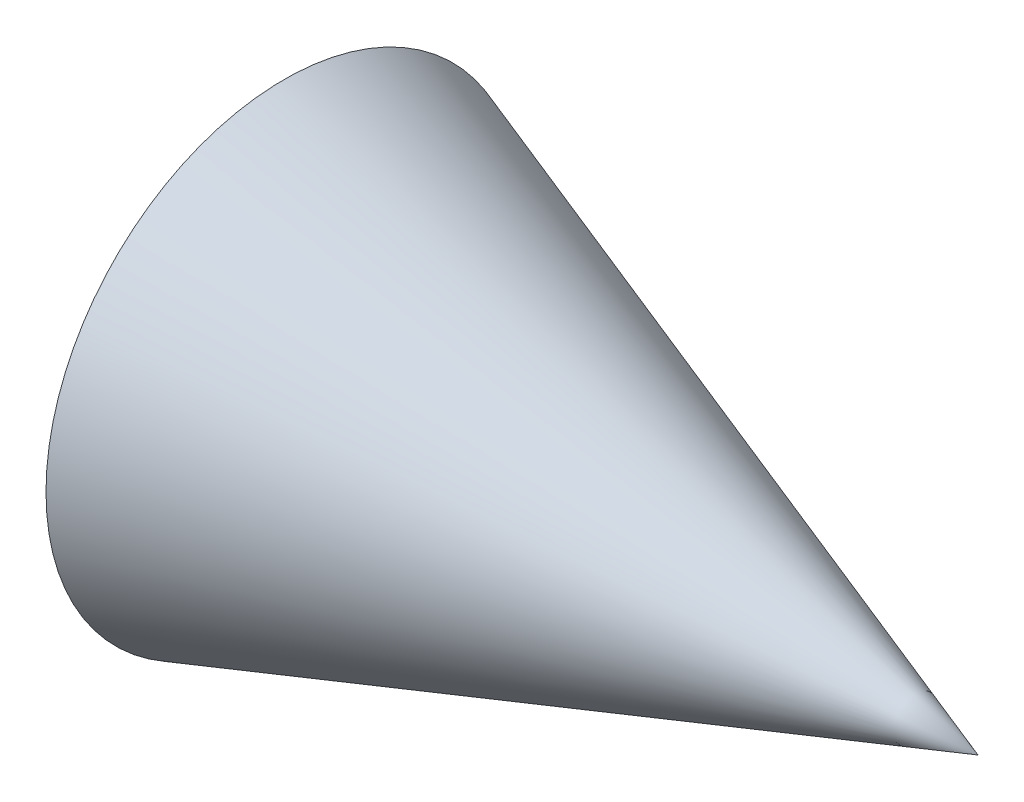
ISO-10303-21;
HEADER;
FILE_DESCRIPTION(('STEP AP214'),'2;1');
FILE_NAME('part.step','',(''),(''),'','','');
FILE_SCHEMA(('AUTOMOTIVE_DESIGN { 1 0 10303 214 1 1 1 1 }'));
ENDSEC;
DATA;
#1=APPLICATION_CONTEXT('core data for automotive mechanical design processes');
#2=APPLICATION_PROTOCOL_DEFINITION('international standard','automotive_design',2000,#1);
#3=PRODUCT_CONTEXT('',#1,'mechanical');
#4=PRODUCT('Part','Part','',(#3));
#5=PRODUCT_RELATED_PRODUCT_CATEGORY('part','',(#4));
#6=PRODUCT_DEFINITION_FORMATION('','',#4);
#7=PRODUCT_DEFINITION_CONTEXT('part definition',#1,'design');
#8=PRODUCT_DEFINITION('design','',#6,#7);
#9=PRODUCT_DEFINITION_SHAPE('','',#8);
#10=(LENGTH_UNIT() NAMED_UNIT(*) SI_UNIT(.MILLI.,.METRE.));
#11=(NAMED_UNIT(*) PLANE_ANGLE_UNIT() SI_UNIT($,.RADIAN.));
#12=(NAMED_UNIT(*) SI_UNIT($,.STERADIAN.) SOLID_ANGLE_UNIT());
#13=UNCERTAINTY_MEASURE_WITH_UNIT(LENGTH_MEASURE(1.E-05),#10,'distance_accuracy_value','');
#14=(GEOMETRIC_REPRESENTATION_CONTEXT(3) GLOBAL_UNCERTAINTY_ASSIGNED_CONTEXT((#13)) GLOBAL_UNIT_ASSIGNED_CONTEXT((#10,
#11,#12)) REPRESENTATION_CONTEXT('',''));
#15=CARTESIAN_POINT('',(0.,0.,0.));
#16=DIRECTION('',(0.,0.,1.));
#17=DIRECTION('',(1.,0.,0.));
#18=AXIS2_PLACEMENT_3D('',#15,#16,#17);
#19=CARTESIAN_POINT('',(15.1428571428572,0.,0.));
#20=DIRECTION('',(-1.,0.,0.));
#21=DIRECTION('',(0.,0.,1.));
#22=AXIS2_PLACEMENT_3D('',#19,#20,#21);
#23=CONICAL_SURFACE('',#22,0.,0.330779654396371);
#24=CARTESIAN_POINT('',(0.,0.,0.));
#25=DIRECTION('',(-1.,0.,0.));
#26=DIRECTION('',(0.,0.,1.));
#27=AXIS2_PLACEMENT_3D('',#24,#25,#26);
#28=CIRCLE('',#27,5.2);
#29=CARTESIAN_POINT('',(0.,0.,5.2));
#30=VERTEX_POINT('',#29);
#31=EDGE_CURVE('E11',#30,#30,#28,.T.);
#32=ORIENTED_EDGE('',*,*,#31,.F.);
#33=EDGE_LOOP('',(#32));
#34=FACE_BOUND('',#33,.T.);
#35=CARTESIAN_POINT('',(15.1428571428572,0.,0.));
#36=VERTEX_POINT('',#35);
#37=VERTEX_LOOP('',#36);
#38=FACE_BOUND('',#37,.T.);
#39=ADVANCED_FACE('F39',(#34,#38),#23,.T.);
#40=CARTESIAN_POINT('',(0.,0.,0.));
#41=DIRECTION('',(1.,0.,0.));
#42=DIRECTION('',(0.,0.,-1.));
#43=AXIS2_PLACEMENT_3D('',#40,#41,#42);
#44=PLANE('',#43);
#45=ORIENTED_EDGE('',*,*,#31,.T.);
#46=EDGE_LOOP('',(#45));
#47=FACE_BOUND('',#46,.T.);
#48=ADVANCED_FACE('F48',(#47),#44,.F.);
#49=CLOSED_SHELL('',(#39,#48));
#50=MANIFOLD_SOLID_BREP('B2',#49);
#51=ADVANCED_BREP_SHAPE_REPRESENTATION('',(#18,#50),#14);
#52=SHAPE_DEFINITION_REPRESENTATION(#9,#51);
ENDSEC;
END-ISO-10303-21;
